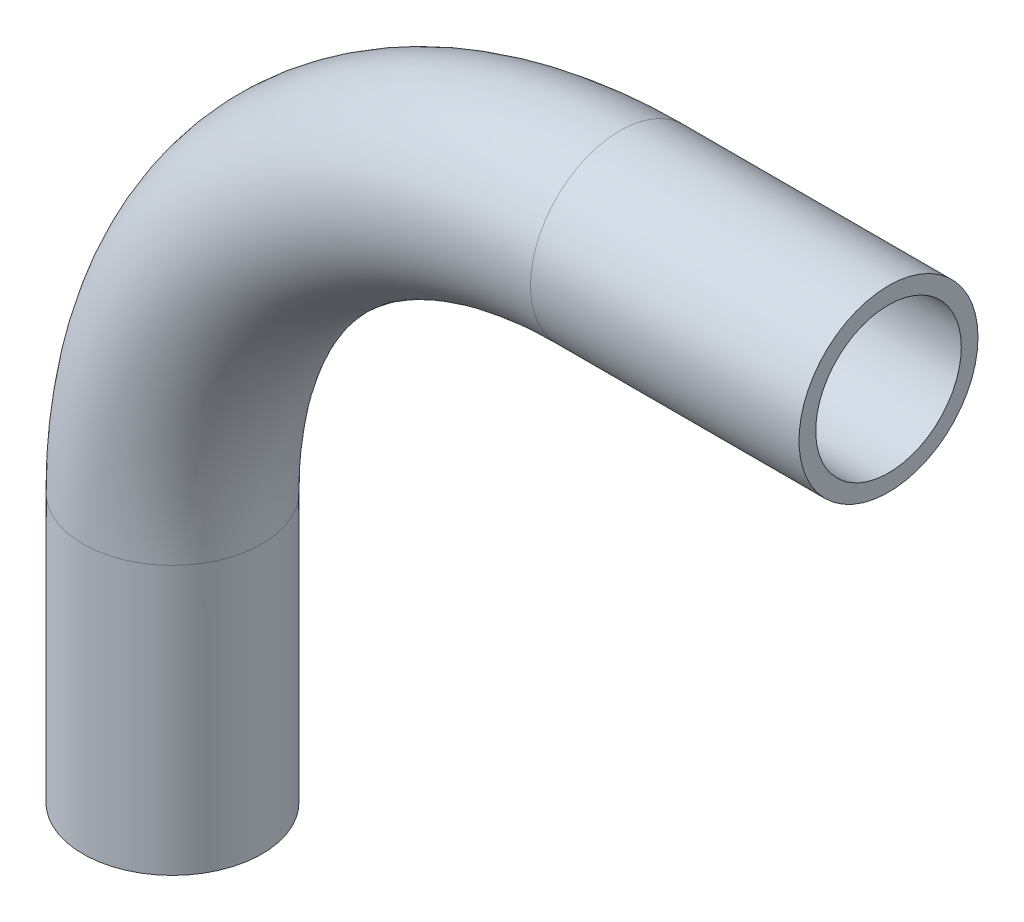
ISO-10303-21;
HEADER;
FILE_DESCRIPTION(('STEP AP214'),'2;1');
FILE_NAME('part.step','',(''),(''),'','','');
FILE_SCHEMA(('AUTOMOTIVE_DESIGN { 1 0 10303 214 1 1 1 1 }'));
ENDSEC;
DATA;
#1=APPLICATION_CONTEXT('core data for automotive mechanical design processes');
#2=APPLICATION_PROTOCOL_DEFINITION('international standard','automotive_design',2000,#1);
#3=PRODUCT_CONTEXT('',#1,'mechanical');
#4=PRODUCT('Part','Part','',(#3));
#5=PRODUCT_RELATED_PRODUCT_CATEGORY('part','',(#4));
#6=PRODUCT_DEFINITION_FORMATION('','',#4);
#7=PRODUCT_DEFINITION_CONTEXT('part definition',#1,'design');
#8=PRODUCT_DEFINITION('design','',#6,#7);
#9=PRODUCT_DEFINITION_SHAPE('','',#8);
#10=(LENGTH_UNIT() NAMED_UNIT(*) SI_UNIT(.MILLI.,.METRE.));
#11=(NAMED_UNIT(*) PLANE_ANGLE_UNIT() SI_UNIT($,.RADIAN.));
#12=(NAMED_UNIT(*) SI_UNIT($,.STERADIAN.) SOLID_ANGLE_UNIT());
#13=UNCERTAINTY_MEASURE_WITH_UNIT(LENGTH_MEASURE(1.E-05),#10,'distance_accuracy_value','');
#14=(GEOMETRIC_REPRESENTATION_CONTEXT(3) GLOBAL_UNCERTAINTY_ASSIGNED_CONTEXT((#13)) GLOBAL_UNIT_ASSIGNED_CONTEXT((#10,
#11,#12)) REPRESENTATION_CONTEXT('',''));
#15=CARTESIAN_POINT('',(0.,0.,0.));
#16=DIRECTION('',(0.,0.,1.));
#17=DIRECTION('',(1.,0.,0.));
#18=AXIS2_PLACEMENT_3D('',#15,#16,#17);
#19=CARTESIAN_POINT('',(-4.50164329221031E-13,-38.1,0.));
#20=DIRECTION('',(0.,1.,0.));
#21=DIRECTION('',(-1.,0.,0.));
#22=AXIS2_PLACEMENT_3D('',#19,#20,#21);
#23=CYLINDRICAL_SURFACE('',#22,4.7625);
#24=CARTESIAN_POINT('',(-2.81025203108243E-13,-23.8125000000001,0.));
#25=DIRECTION('',(0.,1.,0.));
#26=DIRECTION('',(0.,0.,-1.));
#27=AXIS2_PLACEMENT_3D('',#24,#25,#26);
#28=CIRCLE('',#27,4.7625);
#29=CARTESIAN_POINT('',(-4.76250000000028,-23.8125,0.));
#30=VERTEX_POINT('',#29);
#31=EDGE_CURVE('E78',#30,#30,#28,.T.);
#32=ORIENTED_EDGE('',*,*,#31,.F.);
#33=EDGE_LOOP('',(#32));
#34=FACE_BOUND('',#33,.T.);
#35=CARTESIAN_POINT('',(-4.50164329221031E-13,-38.1,0.));
#36=DIRECTION('',(0.,1.,0.));
#37=DIRECTION('',(0.,0.,-1.));
#38=AXIS2_PLACEMENT_3D('',#35,#36,#37);
#39=CIRCLE('',#38,4.7625);
#40=CARTESIAN_POINT('',(-4.50164329221031E-13,-38.1,-4.7625));
#41=VERTEX_POINT('',#40);
#42=EDGE_CURVE('E47',#41,#41,#39,.T.);
#43=ORIENTED_EDGE('',*,*,#42,.T.);
#44=EDGE_LOOP('',(#43));
#45=FACE_BOUND('',#44,.T.);
#46=ADVANCED_FACE('F32',(#34,#45),#23,.T.);
#47=CARTESIAN_POINT('',(23.8124999999997,-23.8125000000004,0.));
#48=DIRECTION('',(0.,0.,-1.));
#49=DIRECTION('',(-1.,0.,0.));
#50=AXIS2_PLACEMENT_3D('',#47,#48,#49);
#51=TOROIDAL_SURFACE('',#50,23.8125,4.7625);
#52=CARTESIAN_POINT('',(23.8125000000001,-3.629279499482E-13,0.));
#53=DIRECTION('',(1.,0.,0.));
#54=DIRECTION('',(0.,0.,-1.));
#55=AXIS2_PLACEMENT_3D('',#52,#53,#54);
#56=CIRCLE('',#55,4.7625);
#57=CARTESIAN_POINT('',(23.8125000000002,4.76249999999962,0.));
#58=VERTEX_POINT('',#57);
#59=EDGE_CURVE('E36',#58,#58,#56,.T.);
#60=CARTESIAN_POINT('',(23.8124999999997,-23.8125000000004,0.));
#61=DIRECTION('',(0.,0.,-1.));
#62=DIRECTION('',(-1.,0.,0.));
#63=AXIS2_PLACEMENT_3D('',#60,#61,#62);
#64=CIRCLE('',#63,28.575);
#65=EDGE_CURVE('',#30,#58,#64,.T.);
#66=ORIENTED_EDGE('',*,*,#31,.T.);
#67=ORIENTED_EDGE('',*,*,#59,.F.);
#68=ORIENTED_EDGE('',*,*,#65,.T.);
#69=ORIENTED_EDGE('',*,*,#65,.F.);
#70=EDGE_LOOP('',(#66,#68,#67,#69));
#71=FACE_BOUND('',#70,.T.);
#72=ADVANCED_FACE('F86',(#71),#51,.T.);
#73=CARTESIAN_POINT('',(23.8125000000001,-3.7470027081099E-13,0.));
#74=DIRECTION('',(1.,0.,0.));
#75=DIRECTION('',(0.,1.,0.));
#76=AXIS2_PLACEMENT_3D('',#73,#74,#75);
#77=CYLINDRICAL_SURFACE('',#76,4.7625);
#78=CARTESIAN_POINT('',(38.1,-5.97187481145209E-13,0.));
#79=DIRECTION('',(1.,0.,0.));
#80=DIRECTION('',(0.,0.,-1.));
#81=AXIS2_PLACEMENT_3D('',#78,#79,#80);
#82=CIRCLE('',#81,4.7625);
#83=CARTESIAN_POINT('',(38.1,-5.97187481145209E-13,-4.7625));
#84=VERTEX_POINT('',#83);
#85=EDGE_CURVE('E52',#84,#84,#82,.T.);
#86=ORIENTED_EDGE('',*,*,#85,.F.);
#87=EDGE_LOOP('',(#86));
#88=FACE_BOUND('',#87,.T.);
#89=ORIENTED_EDGE('',*,*,#59,.T.);
#90=EDGE_LOOP('',(#89));
#91=FACE_BOUND('',#90,.T.);
#92=ADVANCED_FACE('F34',(#88,#91),#77,.T.);
#93=CARTESIAN_POINT('',(-4.50164329221031E-13,-38.1,0.));
#94=DIRECTION('',(0.,1.,0.));
#95=DIRECTION('',(0.,0.,-1.));
#96=AXIS2_PLACEMENT_3D('',#93,#94,#95);
#97=PLANE('',#96);
#98=CARTESIAN_POINT('',(-4.50164329221031E-13,-38.1,0.));
#99=DIRECTION('',(0.,1.,0.));
#100=DIRECTION('',(0.,0.,-1.));
#101=AXIS2_PLACEMENT_3D('',#98,#99,#100);
#102=CIRCLE('',#101,3.8735);
#103=CARTESIAN_POINT('',(-4.50164329221031E-13,-38.1,-3.8735));
#104=VERTEX_POINT('',#103);
#105=EDGE_CURVE('E73',#104,#104,#102,.F.);
#106=ORIENTED_EDGE('',*,*,#105,.F.);
#107=EDGE_LOOP('',(#106));
#108=FACE_BOUND('',#107,.T.);
#109=ORIENTED_EDGE('',*,*,#42,.F.);
#110=EDGE_LOOP('',(#109));
#111=FACE_BOUND('',#110,.T.);
#112=ADVANCED_FACE('F92',(#108,#111),#97,.F.);
#113=CARTESIAN_POINT('',(38.1,-5.97187481145209E-13,0.));
#114=DIRECTION('',(1.,0.,0.));
#115=DIRECTION('',(0.,0.,-1.));
#116=AXIS2_PLACEMENT_3D('',#113,#114,#115);
#117=PLANE('',#116);
#118=CARTESIAN_POINT('',(38.1,-5.97187481145209E-13,0.));
#119=DIRECTION('',(1.,0.,0.));
#120=DIRECTION('',(0.,0.,-1.));
#121=AXIS2_PLACEMENT_3D('',#118,#119,#120);
#122=CIRCLE('',#121,3.8735);
#123=CARTESIAN_POINT('',(38.1,-5.97187481145209E-13,-3.8735));
#124=VERTEX_POINT('',#123);
#125=EDGE_CURVE('E11',#124,#124,#122,.F.);
#126=ORIENTED_EDGE('',*,*,#125,.T.);
#127=EDGE_LOOP('',(#126));
#128=FACE_BOUND('',#127,.T.);
#129=ORIENTED_EDGE('',*,*,#85,.T.);
#130=EDGE_LOOP('',(#129));
#131=FACE_BOUND('',#130,.T.);
#132=ADVANCED_FACE('F59',(#128,#131),#117,.T.);
#133=CARTESIAN_POINT('',(-4.50164329221031E-13,-38.1,0.));
#134=DIRECTION('',(0.,1.,0.));
#135=DIRECTION('',(-1.,0.,0.));
#136=AXIS2_PLACEMENT_3D('',#133,#134,#135);
#137=CYLINDRICAL_SURFACE('',#136,3.8735);
#138=CARTESIAN_POINT('',(-2.81025203108243E-13,-23.8125000000001,0.));
#139=DIRECTION('',(0.,1.,0.));
#140=DIRECTION('',(0.,0.,-1.));
#141=AXIS2_PLACEMENT_3D('',#138,#139,#140);
#142=CIRCLE('',#141,3.8735);
#143=CARTESIAN_POINT('',(-3.87350000000029,-23.8125,0.));
#144=VERTEX_POINT('',#143);
#145=EDGE_CURVE('E70',#144,#144,#142,.F.);
#146=ORIENTED_EDGE('',*,*,#145,.F.);
#147=EDGE_LOOP('',(#146));
#148=FACE_BOUND('',#147,.T.);
#149=ORIENTED_EDGE('',*,*,#105,.T.);
#150=EDGE_LOOP('',(#149));
#151=FACE_BOUND('',#150,.T.);
#152=ADVANCED_FACE('F100',(#148,#151),#137,.F.);
#153=CARTESIAN_POINT('',(23.8124999999997,-23.8125000000004,0.));
#154=DIRECTION('',(0.,0.,-1.));
#155=DIRECTION('',(-1.,0.,0.));
#156=AXIS2_PLACEMENT_3D('',#153,#154,#155);
#157=TOROIDAL_SURFACE('',#156,23.8125,3.8735);
#158=CARTESIAN_POINT('',(23.8125000000001,-3.629279499482E-13,0.));
#159=DIRECTION('',(1.,0.,0.));
#160=DIRECTION('',(0.,0.,-1.));
#161=AXIS2_PLACEMENT_3D('',#158,#159,#160);
#162=CIRCLE('',#161,3.8735);
#163=CARTESIAN_POINT('',(23.8125000000002,3.87349999999963,0.));
#164=VERTEX_POINT('',#163);
#165=EDGE_CURVE('E41',#164,#164,#162,.F.);
#166=CARTESIAN_POINT('',(23.8124999999997,-23.8125000000004,0.));
#167=DIRECTION('',(0.,0.,-1.));
#168=DIRECTION('',(-1.,0.,0.));
#169=AXIS2_PLACEMENT_3D('',#166,#167,#168);
#170=CIRCLE('',#169,27.686);
#171=EDGE_CURVE('',#144,#164,#170,.T.);
#172=ORIENTED_EDGE('',*,*,#145,.T.);
#173=ORIENTED_EDGE('',*,*,#165,.F.);
#174=ORIENTED_EDGE('',*,*,#171,.T.);
#175=ORIENTED_EDGE('',*,*,#171,.F.);
#176=EDGE_LOOP('',(#172,#174,#173,#175));
#177=FACE_BOUND('',#176,.T.);
#178=ADVANCED_FACE('F65',(#177),#157,.F.);
#179=CARTESIAN_POINT('',(23.8125000000001,-3.7470027081099E-13,0.));
#180=DIRECTION('',(1.,0.,0.));
#181=DIRECTION('',(0.,1.,0.));
#182=AXIS2_PLACEMENT_3D('',#179,#180,#181);
#183=CYLINDRICAL_SURFACE('',#182,3.8735);
#184=ORIENTED_EDGE('',*,*,#125,.F.);
#185=EDGE_LOOP('',(#184));
#186=FACE_BOUND('',#185,.T.);
#187=ORIENTED_EDGE('',*,*,#165,.T.);
#188=EDGE_LOOP('',(#187));
#189=FACE_BOUND('',#188,.T.);
#190=ADVANCED_FACE('F62',(#186,#189),#183,.F.);
#191=CLOSED_SHELL('',(#46,#72,#92,#112,#132,#152,#178,#190));
#192=MANIFOLD_SOLID_BREP('B2',#191);
#193=ADVANCED_BREP_SHAPE_REPRESENTATION('',(#18,#192),#14);
#194=SHAPE_DEFINITION_REPRESENTATION(#9,#193);
ENDSEC;
END-ISO-10303-21;
